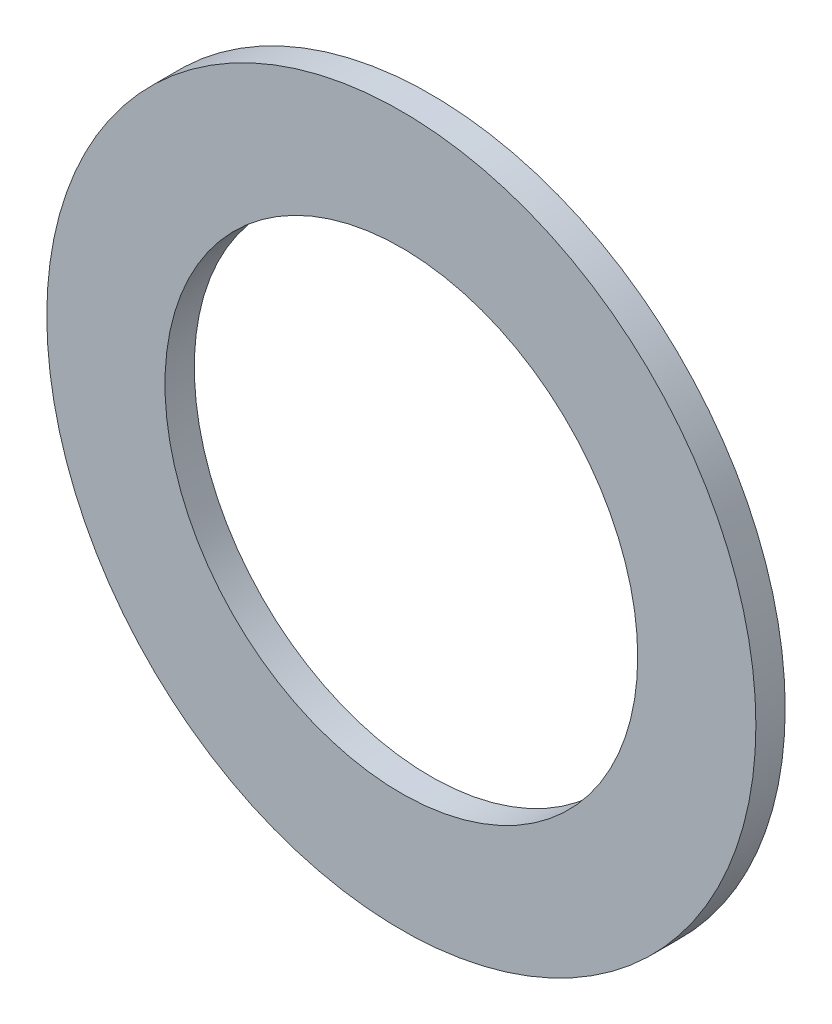
ISO-10303-21;
HEADER;
FILE_DESCRIPTION(('STEP AP214'),'2;1');
FILE_NAME('part.step','',(''),(''),'','','');
FILE_SCHEMA(('AUTOMOTIVE_DESIGN { 1 0 10303 214 1 1 1 1 }'));
ENDSEC;
DATA;
#1=APPLICATION_CONTEXT('core data for automotive mechanical design processes');
#2=APPLICATION_PROTOCOL_DEFINITION('international standard','automotive_design',2000,#1);
#3=PRODUCT_CONTEXT('',#1,'mechanical');
#4=PRODUCT('Part','Part','',(#3));
#5=PRODUCT_RELATED_PRODUCT_CATEGORY('part','',(#4));
#6=PRODUCT_DEFINITION_FORMATION('','',#4);
#7=PRODUCT_DEFINITION_CONTEXT('part definition',#1,'design');
#8=PRODUCT_DEFINITION('design','',#6,#7);
#9=PRODUCT_DEFINITION_SHAPE('','',#8);
#10=(LENGTH_UNIT() NAMED_UNIT(*) SI_UNIT(.MILLI.,.METRE.));
#11=(NAMED_UNIT(*) PLANE_ANGLE_UNIT() SI_UNIT($,.RADIAN.));
#12=(NAMED_UNIT(*) SI_UNIT($,.STERADIAN.) SOLID_ANGLE_UNIT());
#13=UNCERTAINTY_MEASURE_WITH_UNIT(LENGTH_MEASURE(1.E-05),#10,'distance_accuracy_value','');
#14=(GEOMETRIC_REPRESENTATION_CONTEXT(3) GLOBAL_UNCERTAINTY_ASSIGNED_CONTEXT((#13)) GLOBAL_UNIT_ASSIGNED_CONTEXT((#10,
#11,#12)) REPRESENTATION_CONTEXT('',''));
#15=CARTESIAN_POINT('',(0.,0.,0.));
#16=DIRECTION('',(0.,0.,1.));
#17=DIRECTION('',(1.,0.,0.));
#18=AXIS2_PLACEMENT_3D('',#15,#16,#17);
#19=CARTESIAN_POINT('',(0.,0.,0.7874));
#20=DIRECTION('',(0.,0.,1.));
#21=DIRECTION('',(1.,0.,0.));
#22=AXIS2_PLACEMENT_3D('',#19,#20,#21);
#23=PLANE('',#22);
#24=CARTESIAN_POINT('',(0.,0.,0.7874));
#25=DIRECTION('',(0.,0.,1.));
#26=DIRECTION('',(1.,0.,0.));
#27=AXIS2_PLACEMENT_3D('',#24,#25,#26);
#28=CIRCLE('',#27,9.525);
#29=CARTESIAN_POINT('',(9.525,0.,0.7874));
#30=VERTEX_POINT('',#29);
#31=EDGE_CURVE('E10',#30,#30,#28,.T.);
#32=ORIENTED_EDGE('',*,*,#31,.T.);
#33=EDGE_LOOP('',(#32));
#34=FACE_BOUND('',#33,.T.);
#35=CARTESIAN_POINT('',(0.,0.,0.7874));
#36=DIRECTION('',(0.,0.,1.));
#37=DIRECTION('',(1.,0.,0.));
#38=AXIS2_PLACEMENT_3D('',#35,#36,#37);
#39=CIRCLE('',#38,6.35);
#40=CARTESIAN_POINT('',(6.35,0.,0.7874));
#41=VERTEX_POINT('',#40);
#42=EDGE_CURVE('E42',#41,#41,#39,.T.);
#43=ORIENTED_EDGE('',*,*,#42,.F.);
#44=EDGE_LOOP('',(#43));
#45=FACE_BOUND('',#44,.T.);
#46=ADVANCED_FACE('F31',(#34,#45),#23,.T.);
#47=CARTESIAN_POINT('',(0.,0.,0.));
#48=DIRECTION('',(0.,0.,1.));
#49=DIRECTION('',(1.,0.,0.));
#50=AXIS2_PLACEMENT_3D('',#47,#48,#49);
#51=PLANE('',#50);
#52=CARTESIAN_POINT('',(0.,0.,0.));
#53=DIRECTION('',(0.,0.,1.));
#54=DIRECTION('',(1.,0.,0.));
#55=AXIS2_PLACEMENT_3D('',#52,#53,#54);
#56=CIRCLE('',#55,9.525);
#57=CARTESIAN_POINT('',(9.525,0.,0.));
#58=VERTEX_POINT('',#57);
#59=EDGE_CURVE('E35',#58,#58,#56,.T.);
#60=ORIENTED_EDGE('',*,*,#59,.F.);
#61=EDGE_LOOP('',(#60));
#62=FACE_BOUND('',#61,.T.);
#63=CARTESIAN_POINT('',(0.,0.,0.));
#64=DIRECTION('',(0.,0.,1.));
#65=DIRECTION('',(1.,0.,0.));
#66=AXIS2_PLACEMENT_3D('',#63,#64,#65);
#67=CIRCLE('',#66,6.35);
#68=CARTESIAN_POINT('',(6.35,0.,0.));
#69=VERTEX_POINT('',#68);
#70=EDGE_CURVE('E44',#69,#69,#67,.T.);
#71=ORIENTED_EDGE('',*,*,#70,.T.);
#72=EDGE_LOOP('',(#71));
#73=FACE_BOUND('',#72,.T.);
#74=ADVANCED_FACE('F54',(#62,#73),#51,.F.);
#75=CARTESIAN_POINT('',(0.,0.,0.7874));
#76=DIRECTION('',(0.,0.,-1.));
#77=DIRECTION('',(-1.,0.,0.));
#78=AXIS2_PLACEMENT_3D('',#75,#76,#77);
#79=CYLINDRICAL_SURFACE('',#78,9.525);
#80=ORIENTED_EDGE('',*,*,#31,.F.);
#81=EDGE_LOOP('',(#80));
#82=FACE_BOUND('',#81,.T.);
#83=ORIENTED_EDGE('',*,*,#59,.T.);
#84=EDGE_LOOP('',(#83));
#85=FACE_BOUND('',#84,.T.);
#86=ADVANCED_FACE('F33',(#82,#85),#79,.T.);
#87=CARTESIAN_POINT('',(0.,0.,0.7874));
#88=DIRECTION('',(0.,0.,-1.));
#89=DIRECTION('',(-1.,0.,0.));
#90=AXIS2_PLACEMENT_3D('',#87,#88,#89);
#91=CYLINDRICAL_SURFACE('',#90,6.35);
#92=ORIENTED_EDGE('',*,*,#42,.T.);
#93=EDGE_LOOP('',(#92));
#94=FACE_BOUND('',#93,.T.);
#95=ORIENTED_EDGE('',*,*,#70,.F.);
#96=EDGE_LOOP('',(#95));
#97=FACE_BOUND('',#96,.T.);
#98=ADVANCED_FACE('F50',(#94,#97),#91,.F.);
#99=CLOSED_SHELL('',(#46,#74,#86,#98));
#100=MANIFOLD_SOLID_BREP('B2',#99);
#101=ADVANCED_BREP_SHAPE_REPRESENTATION('',(#18,#100),#14);
#102=SHAPE_DEFINITION_REPRESENTATION(#9,#101);
ENDSEC;
END-ISO-10303-21;
